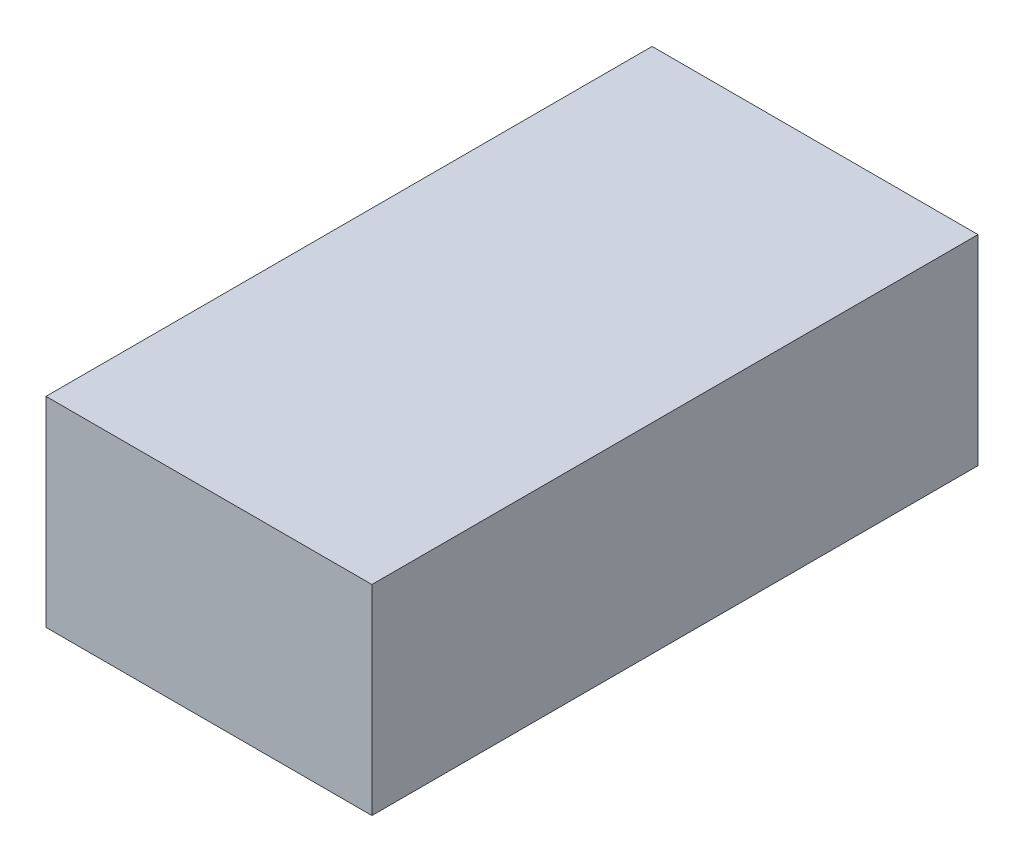
ISO-10303-21;
HEADER;
FILE_DESCRIPTION(('STEP AP214'),'2;1');
FILE_NAME('part.step','',(''),(''),'','','');
FILE_SCHEMA(('AUTOMOTIVE_DESIGN { 1 0 10303 214 1 1 1 1 }'));
ENDSEC;
DATA;
#1=APPLICATION_CONTEXT('core data for automotive mechanical design processes');
#2=APPLICATION_PROTOCOL_DEFINITION('international standard','automotive_design',2000,#1);
#3=PRODUCT_CONTEXT('',#1,'mechanical');
#4=PRODUCT('Part','Part','',(#3));
#5=PRODUCT_RELATED_PRODUCT_CATEGORY('part','',(#4));
#6=PRODUCT_DEFINITION_FORMATION('','',#4);
#7=PRODUCT_DEFINITION_CONTEXT('part definition',#1,'design');
#8=PRODUCT_DEFINITION('design','',#6,#7);
#9=PRODUCT_DEFINITION_SHAPE('','',#8);
#10=(LENGTH_UNIT() NAMED_UNIT(*) SI_UNIT(.MILLI.,.METRE.));
#11=(NAMED_UNIT(*) PLANE_ANGLE_UNIT() SI_UNIT($,.RADIAN.));
#12=(NAMED_UNIT(*) SI_UNIT($,.STERADIAN.) SOLID_ANGLE_UNIT());
#13=UNCERTAINTY_MEASURE_WITH_UNIT(LENGTH_MEASURE(1.E-05),#10,'distance_accuracy_value','');
#14=(GEOMETRIC_REPRESENTATION_CONTEXT(3) GLOBAL_UNCERTAINTY_ASSIGNED_CONTEXT((#13)) GLOBAL_UNIT_ASSIGNED_CONTEXT((#10,
#11,#12)) REPRESENTATION_CONTEXT('',''));
#15=CARTESIAN_POINT('',(0.,0.,0.));
#16=DIRECTION('',(0.,0.,1.));
#17=DIRECTION('',(1.,0.,0.));
#18=AXIS2_PLACEMENT_3D('',#15,#16,#17);
#19=CARTESIAN_POINT('',(0.,35.,0.));
#20=DIRECTION('',(-1.,0.,0.));
#21=DIRECTION('',(0.,0.,1.));
#22=AXIS2_PLACEMENT_3D('',#19,#20,#21);
#23=PLANE('',#22);
#24=DIRECTION('',(0.,0.,-1.));
#25=VECTOR('',#24,1.);
#26=CARTESIAN_POINT('',(0.,0.,0.));
#27=LINE('',#26,#25);
#28=CARTESIAN_POINT('',(0.,0.,106.));
#29=VERTEX_POINT('',#28);
#30=CARTESIAN_POINT('',(0.,0.,0.));
#31=VERTEX_POINT('',#30);
#32=EDGE_CURVE('E96',#29,#31,#27,.T.);
#33=ORIENTED_EDGE('',*,*,#32,.T.);
#34=DIRECTION('',(0.,-1.,0.));
#35=VECTOR('',#34,1.);
#36=CARTESIAN_POINT('',(0.,35.,0.));
#37=LINE('',#36,#35);
#38=CARTESIAN_POINT('',(0.,35.,0.));
#39=VERTEX_POINT('',#38);
#40=EDGE_CURVE('E11',#39,#31,#37,.T.);
#41=ORIENTED_EDGE('',*,*,#40,.F.);
#42=DIRECTION('',(0.,0.,-1.));
#43=VECTOR('',#42,1.);
#44=CARTESIAN_POINT('',(0.,35.,0.));
#45=LINE('',#44,#43);
#46=CARTESIAN_POINT('',(0.,35.,106.));
#47=VERTEX_POINT('',#46);
#48=EDGE_CURVE('E84',#47,#39,#45,.T.);
#49=ORIENTED_EDGE('',*,*,#48,.F.);
#50=DIRECTION('',(0.,-1.,0.));
#51=VECTOR('',#50,1.);
#52=CARTESIAN_POINT('',(0.,35.,106.));
#53=LINE('',#52,#51);
#54=EDGE_CURVE('E92',#47,#29,#53,.T.);
#55=ORIENTED_EDGE('',*,*,#54,.T.);
#56=EDGE_LOOP('',(#33,#41,#49,#55));
#57=FACE_BOUND('',#56,.T.);
#58=ADVANCED_FACE('F33',(#57),#23,.F.);
#59=CARTESIAN_POINT('',(0.,35.,0.));
#60=DIRECTION('',(0.,0.,1.));
#61=DIRECTION('',(1.,0.,0.));
#62=AXIS2_PLACEMENT_3D('',#59,#60,#61);
#63=PLANE('',#62);
#64=DIRECTION('',(-1.,0.,0.));
#65=VECTOR('',#64,1.);
#66=CARTESIAN_POINT('',(0.,0.,0.));
#67=LINE('',#66,#65);
#68=CARTESIAN_POINT('',(-57.,0.,0.));
#69=VERTEX_POINT('',#68);
#70=EDGE_CURVE('E88',#31,#69,#67,.T.);
#71=ORIENTED_EDGE('',*,*,#70,.T.);
#72=DIRECTION('',(0.,-1.,0.));
#73=VECTOR('',#72,1.);
#74=CARTESIAN_POINT('',(-57.,35.,0.));
#75=LINE('',#74,#73);
#76=CARTESIAN_POINT('',(-57.,35.,0.));
#77=VERTEX_POINT('',#76);
#78=EDGE_CURVE('E41',#77,#69,#75,.T.);
#79=ORIENTED_EDGE('',*,*,#78,.F.);
#80=DIRECTION('',(-1.,0.,0.));
#81=VECTOR('',#80,1.);
#82=CARTESIAN_POINT('',(0.,35.,0.));
#83=LINE('',#82,#81);
#84=EDGE_CURVE('E79',#39,#77,#83,.T.);
#85=ORIENTED_EDGE('',*,*,#84,.F.);
#86=ORIENTED_EDGE('',*,*,#40,.T.);
#87=EDGE_LOOP('',(#71,#79,#85,#86));
#88=FACE_BOUND('',#87,.T.);
#89=ADVANCED_FACE('F87',(#88),#63,.F.);
#90=CARTESIAN_POINT('',(-57.,35.,0.));
#91=DIRECTION('',(1.,0.,0.));
#92=DIRECTION('',(0.,0.,-1.));
#93=AXIS2_PLACEMENT_3D('',#90,#91,#92);
#94=PLANE('',#93);
#95=DIRECTION('',(0.,0.,1.));
#96=VECTOR('',#95,1.);
#97=CARTESIAN_POINT('',(-57.,0.,0.));
#98=LINE('',#97,#96);
#99=CARTESIAN_POINT('',(-57.,0.,106.));
#100=VERTEX_POINT('',#99);
#101=EDGE_CURVE('E66',#69,#100,#98,.T.);
#102=ORIENTED_EDGE('',*,*,#101,.T.);
#103=DIRECTION('',(0.,-1.,0.));
#104=VECTOR('',#103,1.);
#105=CARTESIAN_POINT('',(-57.,35.,106.));
#106=LINE('',#105,#104);
#107=CARTESIAN_POINT('',(-57.,35.,106.));
#108=VERTEX_POINT('',#107);
#109=EDGE_CURVE('E89',#108,#100,#106,.T.);
#110=ORIENTED_EDGE('',*,*,#109,.F.);
#111=DIRECTION('',(0.,0.,1.));
#112=VECTOR('',#111,1.);
#113=CARTESIAN_POINT('',(-57.,35.,0.));
#114=LINE('',#113,#112);
#115=EDGE_CURVE('E82',#77,#108,#114,.T.);
#116=ORIENTED_EDGE('',*,*,#115,.F.);
#117=ORIENTED_EDGE('',*,*,#78,.T.);
#118=EDGE_LOOP('',(#102,#110,#116,#117));
#119=FACE_BOUND('',#118,.T.);
#120=ADVANCED_FACE('F90',(#119),#94,.F.);
#121=CARTESIAN_POINT('',(0.,35.,106.));
#122=DIRECTION('',(0.,0.,-1.));
#123=DIRECTION('',(-1.,0.,0.));
#124=AXIS2_PLACEMENT_3D('',#121,#122,#123);
#125=PLANE('',#124);
#126=DIRECTION('',(1.,0.,0.));
#127=VECTOR('',#126,1.);
#128=CARTESIAN_POINT('',(0.,0.,106.));
#129=LINE('',#128,#127);
#130=EDGE_CURVE('E72',#100,#29,#129,.T.);
#131=ORIENTED_EDGE('',*,*,#130,.T.);
#132=ORIENTED_EDGE('',*,*,#54,.F.);
#133=DIRECTION('',(1.,0.,0.));
#134=VECTOR('',#133,1.);
#135=CARTESIAN_POINT('',(0.,35.,106.));
#136=LINE('',#135,#134);
#137=EDGE_CURVE('E49',#108,#47,#136,.T.);
#138=ORIENTED_EDGE('',*,*,#137,.F.);
#139=ORIENTED_EDGE('',*,*,#109,.T.);
#140=EDGE_LOOP('',(#131,#132,#138,#139));
#141=FACE_BOUND('',#140,.T.);
#142=ADVANCED_FACE('F103',(#141),#125,.F.);
#143=CARTESIAN_POINT('',(0.,35.,0.));
#144=DIRECTION('',(0.,-1.,0.));
#145=DIRECTION('',(0.,0.,-1.));
#146=AXIS2_PLACEMENT_3D('',#143,#144,#145);
#147=PLANE('',#146);
#148=ORIENTED_EDGE('',*,*,#48,.T.);
#149=ORIENTED_EDGE('',*,*,#84,.T.);
#150=ORIENTED_EDGE('',*,*,#115,.T.);
#151=ORIENTED_EDGE('',*,*,#137,.T.);
#152=EDGE_LOOP('',(#148,#149,#150,#151));
#153=FACE_BOUND('',#152,.T.);
#154=ADVANCED_FACE('F80',(#153),#147,.F.);
#155=CARTESIAN_POINT('',(0.,0.,0.));
#156=DIRECTION('',(0.,-1.,0.));
#157=DIRECTION('',(0.,0.,-1.));
#158=AXIS2_PLACEMENT_3D('',#155,#156,#157);
#159=PLANE('',#158);
#160=ORIENTED_EDGE('',*,*,#32,.F.);
#161=ORIENTED_EDGE('',*,*,#130,.F.);
#162=ORIENTED_EDGE('',*,*,#101,.F.);
#163=ORIENTED_EDGE('',*,*,#70,.F.);
#164=EDGE_LOOP('',(#160,#161,#162,#163));
#165=FACE_BOUND('',#164,.T.);
#166=ADVANCED_FACE('F106',(#165),#159,.T.);
#167=CLOSED_SHELL('',(#58,#89,#120,#142,#154,#166));
#168=MANIFOLD_SOLID_BREP('B2',#167);
#169=ADVANCED_BREP_SHAPE_REPRESENTATION('',(#18,#168),#14);
#170=SHAPE_DEFINITION_REPRESENTATION(#9,#169);
ENDSEC;
END-ISO-10303-21;
